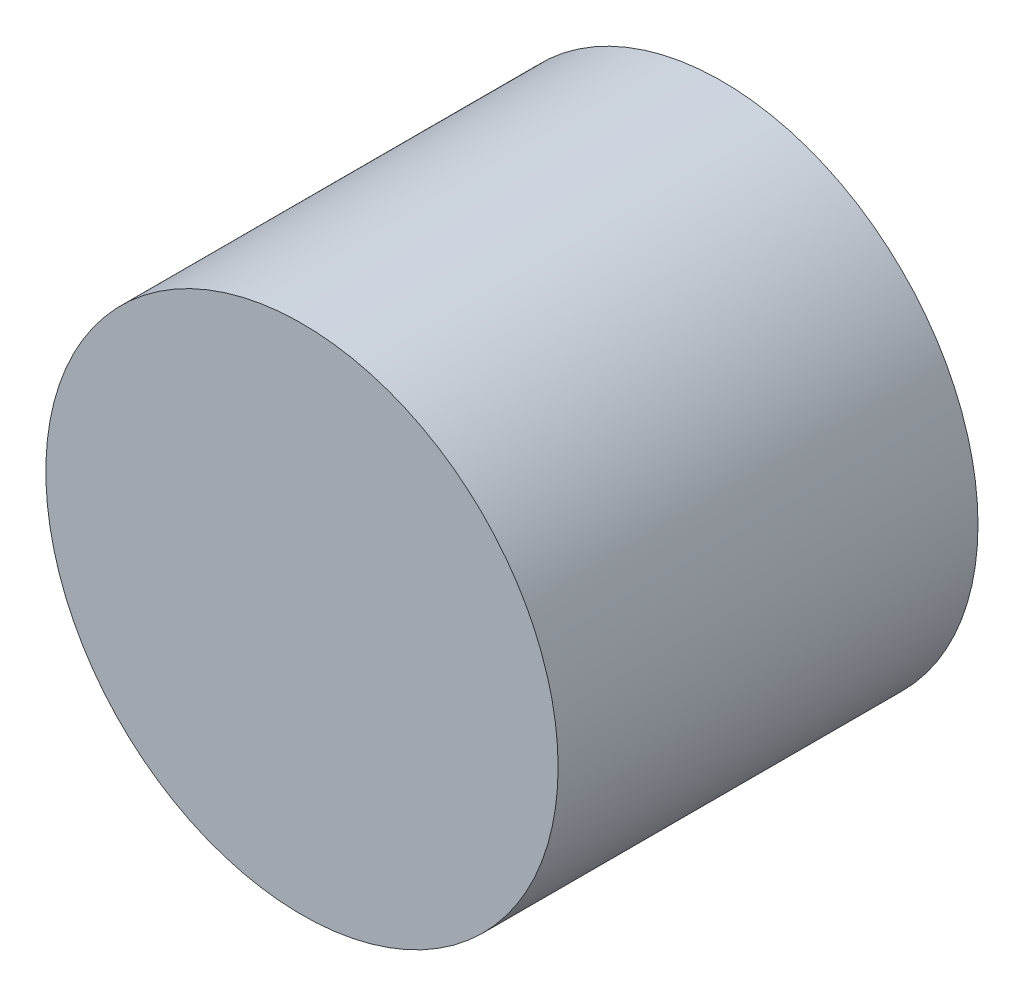
ISO-10303-21;
HEADER;
FILE_DESCRIPTION(('STEP AP214'),'2;1');
FILE_NAME('part.step','',(''),(''),'','','');
FILE_SCHEMA(('AUTOMOTIVE_DESIGN { 1 0 10303 214 1 1 1 1 }'));
ENDSEC;
DATA;
#1=APPLICATION_CONTEXT('core data for automotive mechanical design processes');
#2=APPLICATION_PROTOCOL_DEFINITION('international standard','automotive_design',2000,#1);
#3=PRODUCT_CONTEXT('',#1,'mechanical');
#4=PRODUCT('Part','Part','',(#3));
#5=PRODUCT_RELATED_PRODUCT_CATEGORY('part','',(#4));
#6=PRODUCT_DEFINITION_FORMATION('','',#4);
#7=PRODUCT_DEFINITION_CONTEXT('part definition',#1,'design');
#8=PRODUCT_DEFINITION('design','',#6,#7);
#9=PRODUCT_DEFINITION_SHAPE('','',#8);
#10=(LENGTH_UNIT() NAMED_UNIT(*) SI_UNIT(.MILLI.,.METRE.));
#11=(NAMED_UNIT(*) PLANE_ANGLE_UNIT() SI_UNIT($,.RADIAN.));
#12=(NAMED_UNIT(*) SI_UNIT($,.STERADIAN.) SOLID_ANGLE_UNIT());
#13=UNCERTAINTY_MEASURE_WITH_UNIT(LENGTH_MEASURE(1.E-05),#10,'distance_accuracy_value','');
#14=(GEOMETRIC_REPRESENTATION_CONTEXT(3) GLOBAL_UNCERTAINTY_ASSIGNED_CONTEXT((#13)) GLOBAL_UNIT_ASSIGNED_CONTEXT((#10,
#11,#12)) REPRESENTATION_CONTEXT('',''));
#15=CARTESIAN_POINT('',(0.,0.,0.));
#16=DIRECTION('',(0.,0.,1.));
#17=DIRECTION('',(1.,0.,0.));
#18=AXIS2_PLACEMENT_3D('',#15,#16,#17);
#19=CARTESIAN_POINT('',(0.,0.,10.));
#20=DIRECTION('',(0.,0.,-1.));
#21=DIRECTION('',(-1.,0.,0.));
#22=AXIS2_PLACEMENT_3D('',#19,#20,#21);
#23=CYLINDRICAL_SURFACE('',#22,6.1);
#24=CARTESIAN_POINT('',(0.,0.,10.));
#25=DIRECTION('',(0.,0.,1.));
#26=DIRECTION('',(1.,0.,0.));
#27=AXIS2_PLACEMENT_3D('',#24,#25,#26);
#28=CIRCLE('',#27,6.1);
#29=CARTESIAN_POINT('',(6.1,0.,10.));
#30=VERTEX_POINT('',#29);
#31=EDGE_CURVE('E10',#30,#30,#28,.T.);
#32=ORIENTED_EDGE('',*,*,#31,.F.);
#33=EDGE_LOOP('',(#32));
#34=FACE_BOUND('',#33,.T.);
#35=CARTESIAN_POINT('',(0.,0.,0.));
#36=DIRECTION('',(0.,0.,1.));
#37=DIRECTION('',(1.,0.,0.));
#38=AXIS2_PLACEMENT_3D('',#35,#36,#37);
#39=CIRCLE('',#38,6.1);
#40=CARTESIAN_POINT('',(6.1,0.,0.));
#41=VERTEX_POINT('',#40);
#42=EDGE_CURVE('E34',#41,#41,#39,.T.);
#43=ORIENTED_EDGE('',*,*,#42,.T.);
#44=EDGE_LOOP('',(#43));
#45=FACE_BOUND('',#44,.T.);
#46=ADVANCED_FACE('F31',(#34,#45),#23,.T.);
#47=CARTESIAN_POINT('',(0.,0.,10.));
#48=DIRECTION('',(0.,0.,1.));
#49=DIRECTION('',(1.,0.,0.));
#50=AXIS2_PLACEMENT_3D('',#47,#48,#49);
#51=PLANE('',#50);
#52=ORIENTED_EDGE('',*,*,#31,.T.);
#53=EDGE_LOOP('',(#52));
#54=FACE_BOUND('',#53,.T.);
#55=ADVANCED_FACE('F46',(#54),#51,.T.);
#56=CARTESIAN_POINT('',(0.,0.,0.));
#57=DIRECTION('',(0.,0.,1.));
#58=DIRECTION('',(1.,0.,0.));
#59=AXIS2_PLACEMENT_3D('',#56,#57,#58);
#60=PLANE('',#59);
#61=ORIENTED_EDGE('',*,*,#42,.F.);
#62=EDGE_LOOP('',(#61));
#63=FACE_BOUND('',#62,.T.);
#64=ADVANCED_FACE('F44',(#63),#60,.F.);
#65=CLOSED_SHELL('',(#46,#55,#64));
#66=MANIFOLD_SOLID_BREP('B2',#65);
#67=ADVANCED_BREP_SHAPE_REPRESENTATION('',(#18,#66),#14);
#68=SHAPE_DEFINITION_REPRESENTATION(#9,#67);
ENDSEC;
END-ISO-10303-21;
